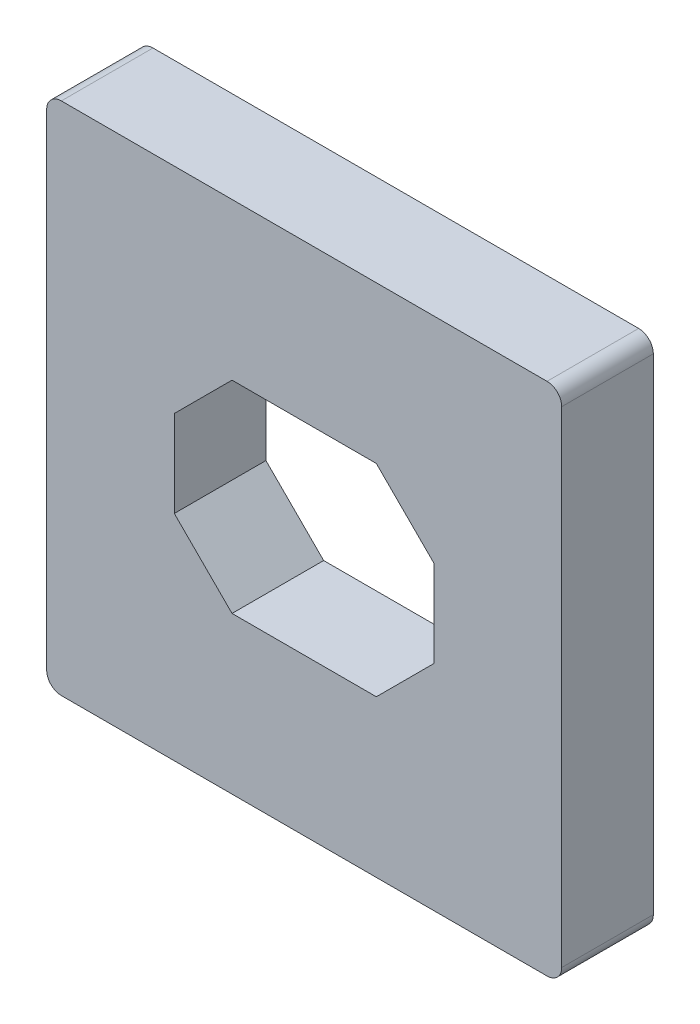
ISO-10303-21;
HEADER;
FILE_DESCRIPTION(('STEP AP214'),'2;1');
FILE_NAME('part.step','',(''),(''),'','','');
FILE_SCHEMA(('AUTOMOTIVE_DESIGN { 1 0 10303 214 1 1 1 1 }'));
ENDSEC;
DATA;
#1=APPLICATION_CONTEXT('core data for automotive mechanical design processes');
#2=APPLICATION_PROTOCOL_DEFINITION('international standard','automotive_design',2000,#1);
#3=PRODUCT_CONTEXT('',#1,'mechanical');
#4=PRODUCT('Part','Part','',(#3));
#5=PRODUCT_RELATED_PRODUCT_CATEGORY('part','',(#4));
#6=PRODUCT_DEFINITION_FORMATION('','',#4);
#7=PRODUCT_DEFINITION_CONTEXT('part definition',#1,'design');
#8=PRODUCT_DEFINITION('design','',#6,#7);
#9=PRODUCT_DEFINITION_SHAPE('','',#8);
#10=(LENGTH_UNIT() NAMED_UNIT(*) SI_UNIT(.MILLI.,.METRE.));
#11=(NAMED_UNIT(*) PLANE_ANGLE_UNIT() SI_UNIT($,.RADIAN.));
#12=(NAMED_UNIT(*) SI_UNIT($,.STERADIAN.) SOLID_ANGLE_UNIT());
#13=UNCERTAINTY_MEASURE_WITH_UNIT(LENGTH_MEASURE(1.E-05),#10,'distance_accuracy_value','');
#14=(GEOMETRIC_REPRESENTATION_CONTEXT(3) GLOBAL_UNCERTAINTY_ASSIGNED_CONTEXT((#13)) GLOBAL_UNIT_ASSIGNED_CONTEXT((#10,
#11,#12)) REPRESENTATION_CONTEXT('',''));
#15=CARTESIAN_POINT('',(0.,0.,0.));
#16=DIRECTION('',(0.,0.,1.));
#17=DIRECTION('',(1.,0.,0.));
#18=AXIS2_PLACEMENT_3D('',#15,#16,#17);
#19=CARTESIAN_POINT('',(4.207,4.207,1.5875));
#20=DIRECTION('',(0.,0.,-1.));
#21=DIRECTION('',(-1.,0.,0.));
#22=AXIS2_PLACEMENT_3D('',#19,#20,#21);
#23=CYLINDRICAL_SURFACE('',#22,0.254000000000002);
#24=CARTESIAN_POINT('',(4.207,4.207,0.));
#25=DIRECTION('',(0.,0.,1.));
#26=DIRECTION('',(1.,0.,0.));
#27=AXIS2_PLACEMENT_3D('',#24,#25,#26);
#28=CIRCLE('',#27,0.254000000000002);
#29=CARTESIAN_POINT('',(4.461,4.207,0.));
#30=VERTEX_POINT('',#29);
#31=CARTESIAN_POINT('',(4.207,4.461,0.));
#32=VERTEX_POINT('',#31);
#33=EDGE_CURVE('E176',#30,#32,#28,.T.);
#34=ORIENTED_EDGE('',*,*,#33,.T.);
#35=DIRECTION('',(0.,0.,-1.));
#36=VECTOR('',#35,1.);
#37=CARTESIAN_POINT('',(4.207,4.461,1.5875));
#38=LINE('',#37,#36);
#39=CARTESIAN_POINT('',(4.207,4.461,1.5875));
#40=VERTEX_POINT('',#39);
#41=EDGE_CURVE('E157',#40,#32,#38,.T.);
#42=ORIENTED_EDGE('',*,*,#41,.F.);
#43=CARTESIAN_POINT('',(4.207,4.207,1.5875));
#44=DIRECTION('',(0.,0.,1.));
#45=DIRECTION('',(1.,0.,0.));
#46=AXIS2_PLACEMENT_3D('',#43,#44,#45);
#47=CIRCLE('',#46,0.254000000000002);
#48=CARTESIAN_POINT('',(4.461,4.207,1.5875));
#49=VERTEX_POINT('',#48);
#50=EDGE_CURVE('E164',#49,#40,#47,.T.);
#51=ORIENTED_EDGE('',*,*,#50,.F.);
#52=DIRECTION('',(0.,0.,-1.));
#53=VECTOR('',#52,1.);
#54=CARTESIAN_POINT('',(4.461,4.207,1.5875));
#55=LINE('',#54,#53);
#56=EDGE_CURVE('E259',#49,#30,#55,.T.);
#57=ORIENTED_EDGE('',*,*,#56,.T.);
#58=EDGE_LOOP('',(#34,#42,#51,#57));
#59=FACE_BOUND('',#58,.T.);
#60=ADVANCED_FACE('F39',(#59),#23,.T.);
#61=CARTESIAN_POINT('',(4.207,4.461,1.5875));
#62=DIRECTION('',(0.,-1.,0.));
#63=DIRECTION('',(0.,0.,-1.));
#64=AXIS2_PLACEMENT_3D('',#61,#62,#63);
#65=PLANE('',#64);
#66=DIRECTION('',(-1.,0.,0.));
#67=VECTOR('',#66,1.);
#68=CARTESIAN_POINT('',(4.207,4.461,0.));
#69=LINE('',#68,#67);
#70=CARTESIAN_POINT('',(-4.207,4.461,0.));
#71=VERTEX_POINT('',#70);
#72=EDGE_CURVE('E261',#32,#71,#69,.T.);
#73=ORIENTED_EDGE('',*,*,#72,.T.);
#74=DIRECTION('',(0.,0.,-1.));
#75=VECTOR('',#74,1.);
#76=CARTESIAN_POINT('',(-4.207,4.461,1.5875));
#77=LINE('',#76,#75);
#78=CARTESIAN_POINT('',(-4.207,4.461,1.5875));
#79=VERTEX_POINT('',#78);
#80=EDGE_CURVE('E160',#79,#71,#77,.T.);
#81=ORIENTED_EDGE('',*,*,#80,.F.);
#82=DIRECTION('',(-1.,0.,0.));
#83=VECTOR('',#82,1.);
#84=CARTESIAN_POINT('',(4.207,4.461,1.5875));
#85=LINE('',#84,#83);
#86=EDGE_CURVE('E153',#40,#79,#85,.T.);
#87=ORIENTED_EDGE('',*,*,#86,.F.);
#88=ORIENTED_EDGE('',*,*,#41,.T.);
#89=EDGE_LOOP('',(#73,#81,#87,#88));
#90=FACE_BOUND('',#89,.T.);
#91=ADVANCED_FACE('F155',(#90),#65,.F.);
#92=CARTESIAN_POINT('',(-4.207,4.207,1.5875));
#93=DIRECTION('',(0.,0.,-1.));
#94=DIRECTION('',(-1.,0.,0.));
#95=AXIS2_PLACEMENT_3D('',#92,#93,#94);
#96=CYLINDRICAL_SURFACE('',#95,0.254);
#97=CARTESIAN_POINT('',(-4.207,4.207,0.));
#98=DIRECTION('',(0.,0.,1.));
#99=DIRECTION('',(1.,0.,0.));
#100=AXIS2_PLACEMENT_3D('',#97,#98,#99);
#101=CIRCLE('',#100,0.254);
#102=CARTESIAN_POINT('',(-4.461,4.207,0.));
#103=VERTEX_POINT('',#102);
#104=EDGE_CURVE('E263',#71,#103,#101,.T.);
#105=ORIENTED_EDGE('',*,*,#104,.T.);
#106=DIRECTION('',(0.,0.,-1.));
#107=VECTOR('',#106,1.);
#108=CARTESIAN_POINT('',(-4.461,4.207,1.5875));
#109=LINE('',#108,#107);
#110=CARTESIAN_POINT('',(-4.461,4.207,1.5875));
#111=VERTEX_POINT('',#110);
#112=EDGE_CURVE('E181',#111,#103,#109,.T.);
#113=ORIENTED_EDGE('',*,*,#112,.F.);
#114=CARTESIAN_POINT('',(-4.207,4.207,1.5875));
#115=DIRECTION('',(0.,0.,1.));
#116=DIRECTION('',(1.,0.,0.));
#117=AXIS2_PLACEMENT_3D('',#114,#115,#116);
#118=CIRCLE('',#117,0.254);
#119=EDGE_CURVE('E163',#79,#111,#118,.T.);
#120=ORIENTED_EDGE('',*,*,#119,.F.);
#121=ORIENTED_EDGE('',*,*,#80,.T.);
#122=EDGE_LOOP('',(#105,#113,#120,#121));
#123=FACE_BOUND('',#122,.T.);
#124=ADVANCED_FACE('F308',(#123),#96,.T.);
#125=CARTESIAN_POINT('',(-4.461,4.207,1.5875));
#126=DIRECTION('',(1.,0.,0.));
#127=DIRECTION('',(0.,0.,-1.));
#128=AXIS2_PLACEMENT_3D('',#125,#126,#127);
#129=PLANE('',#128);
#130=DIRECTION('',(0.,-1.,0.));
#131=VECTOR('',#130,1.);
#132=CARTESIAN_POINT('',(-4.461,4.207,0.));
#133=LINE('',#132,#131);
#134=CARTESIAN_POINT('',(-4.461,-4.207,0.));
#135=VERTEX_POINT('',#134);
#136=EDGE_CURVE('E265',#103,#135,#133,.T.);
#137=ORIENTED_EDGE('',*,*,#136,.T.);
#138=DIRECTION('',(0.,0.,-1.));
#139=VECTOR('',#138,1.);
#140=CARTESIAN_POINT('',(-4.461,-4.207,1.5875));
#141=LINE('',#140,#139);
#142=CARTESIAN_POINT('',(-4.461,-4.207,1.5875));
#143=VERTEX_POINT('',#142);
#144=EDGE_CURVE('E284',#143,#135,#141,.T.);
#145=ORIENTED_EDGE('',*,*,#144,.F.);
#146=DIRECTION('',(0.,-1.,0.));
#147=VECTOR('',#146,1.);
#148=CARTESIAN_POINT('',(-4.461,4.207,1.5875));
#149=LINE('',#148,#147);
#150=EDGE_CURVE('E250',#111,#143,#149,.T.);
#151=ORIENTED_EDGE('',*,*,#150,.F.);
#152=ORIENTED_EDGE('',*,*,#112,.T.);
#153=EDGE_LOOP('',(#137,#145,#151,#152));
#154=FACE_BOUND('',#153,.T.);
#155=ADVANCED_FACE('F291',(#154),#129,.F.);
#156=CARTESIAN_POINT('',(-4.207,-4.207,1.5875));
#157=DIRECTION('',(0.,0.,-1.));
#158=DIRECTION('',(-1.,0.,0.));
#159=AXIS2_PLACEMENT_3D('',#156,#157,#158);
#160=CYLINDRICAL_SURFACE('',#159,0.254000000000003);
#161=CARTESIAN_POINT('',(-4.207,-4.207,0.));
#162=DIRECTION('',(0.,0.,1.));
#163=DIRECTION('',(1.,0.,0.));
#164=AXIS2_PLACEMENT_3D('',#161,#162,#163);
#165=CIRCLE('',#164,0.254000000000003);
#166=CARTESIAN_POINT('',(-4.207,-4.461,0.));
#167=VERTEX_POINT('',#166);
#168=EDGE_CURVE('E267',#135,#167,#165,.T.);
#169=ORIENTED_EDGE('',*,*,#168,.T.);
#170=DIRECTION('',(0.,0.,-1.));
#171=VECTOR('',#170,1.);
#172=CARTESIAN_POINT('',(-4.207,-4.461,1.5875));
#173=LINE('',#172,#171);
#174=CARTESIAN_POINT('',(-4.207,-4.461,1.5875));
#175=VERTEX_POINT('',#174);
#176=EDGE_CURVE('E281',#175,#167,#173,.T.);
#177=ORIENTED_EDGE('',*,*,#176,.F.);
#178=CARTESIAN_POINT('',(-4.207,-4.207,1.5875));
#179=DIRECTION('',(0.,0.,1.));
#180=DIRECTION('',(1.,0.,0.));
#181=AXIS2_PLACEMENT_3D('',#178,#179,#180);
#182=CIRCLE('',#181,0.254000000000003);
#183=EDGE_CURVE('E252',#143,#175,#182,.T.);
#184=ORIENTED_EDGE('',*,*,#183,.F.);
#185=ORIENTED_EDGE('',*,*,#144,.T.);
#186=EDGE_LOOP('',(#169,#177,#184,#185));
#187=FACE_BOUND('',#186,.T.);
#188=ADVANCED_FACE('F300',(#187),#160,.T.);
#189=CARTESIAN_POINT('',(-4.207,-4.461,1.5875));
#190=DIRECTION('',(0.,1.,0.));
#191=DIRECTION('',(0.,0.,1.));
#192=AXIS2_PLACEMENT_3D('',#189,#190,#191);
#193=PLANE('',#192);
#194=DIRECTION('',(1.,0.,0.));
#195=VECTOR('',#194,1.);
#196=CARTESIAN_POINT('',(-4.207,-4.461,0.));
#197=LINE('',#196,#195);
#198=CARTESIAN_POINT('',(4.207,-4.461,0.));
#199=VERTEX_POINT('',#198);
#200=EDGE_CURVE('E269',#167,#199,#197,.T.);
#201=ORIENTED_EDGE('',*,*,#200,.T.);
#202=DIRECTION('',(0.,0.,-1.));
#203=VECTOR('',#202,1.);
#204=CARTESIAN_POINT('',(4.207,-4.461,1.5875));
#205=LINE('',#204,#203);
#206=CARTESIAN_POINT('',(4.207,-4.461,1.5875));
#207=VERTEX_POINT('',#206);
#208=EDGE_CURVE('E278',#207,#199,#205,.T.);
#209=ORIENTED_EDGE('',*,*,#208,.F.);
#210=DIRECTION('',(1.,0.,0.));
#211=VECTOR('',#210,1.);
#212=CARTESIAN_POINT('',(-4.207,-4.461,1.5875));
#213=LINE('',#212,#211);
#214=EDGE_CURVE('E254',#175,#207,#213,.T.);
#215=ORIENTED_EDGE('',*,*,#214,.F.);
#216=ORIENTED_EDGE('',*,*,#176,.T.);
#217=EDGE_LOOP('',(#201,#209,#215,#216));
#218=FACE_BOUND('',#217,.T.);
#219=ADVANCED_FACE('F304',(#218),#193,.F.);
#220=CARTESIAN_POINT('',(4.207,-4.207,1.5875));
#221=DIRECTION('',(0.,0.,-1.));
#222=DIRECTION('',(-1.,0.,0.));
#223=AXIS2_PLACEMENT_3D('',#220,#221,#222);
#224=CYLINDRICAL_SURFACE('',#223,0.254);
#225=CARTESIAN_POINT('',(4.207,-4.207,0.));
#226=DIRECTION('',(0.,0.,1.));
#227=DIRECTION('',(1.,0.,0.));
#228=AXIS2_PLACEMENT_3D('',#225,#226,#227);
#229=CIRCLE('',#228,0.254);
#230=CARTESIAN_POINT('',(4.461,-4.207,0.));
#231=VERTEX_POINT('',#230);
#232=EDGE_CURVE('E271',#199,#231,#229,.T.);
#233=ORIENTED_EDGE('',*,*,#232,.T.);
#234=DIRECTION('',(0.,0.,-1.));
#235=VECTOR('',#234,1.);
#236=CARTESIAN_POINT('',(4.461,-4.207,1.5875));
#237=LINE('',#236,#235);
#238=CARTESIAN_POINT('',(4.461,-4.207,1.5875));
#239=VERTEX_POINT('',#238);
#240=EDGE_CURVE('E275',#239,#231,#237,.T.);
#241=ORIENTED_EDGE('',*,*,#240,.F.);
#242=CARTESIAN_POINT('',(4.207,-4.207,1.5875));
#243=DIRECTION('',(0.,0.,1.));
#244=DIRECTION('',(1.,0.,0.));
#245=AXIS2_PLACEMENT_3D('',#242,#243,#244);
#246=CIRCLE('',#245,0.254);
#247=EDGE_CURVE('E256',#207,#239,#246,.T.);
#248=ORIENTED_EDGE('',*,*,#247,.F.);
#249=ORIENTED_EDGE('',*,*,#208,.T.);
#250=EDGE_LOOP('',(#233,#241,#248,#249));
#251=FACE_BOUND('',#250,.T.);
#252=ADVANCED_FACE('F365',(#251),#224,.T.);
#253=CARTESIAN_POINT('',(4.461,-4.207,1.5875));
#254=DIRECTION('',(-1.,0.,0.));
#255=DIRECTION('',(0.,0.,1.));
#256=AXIS2_PLACEMENT_3D('',#253,#254,#255);
#257=PLANE('',#256);
#258=DIRECTION('',(0.,1.,0.));
#259=VECTOR('',#258,1.);
#260=CARTESIAN_POINT('',(4.461,-4.207,0.));
#261=LINE('',#260,#259);
#262=EDGE_CURVE('E173',#231,#30,#261,.T.);
#263=ORIENTED_EDGE('',*,*,#262,.T.);
#264=ORIENTED_EDGE('',*,*,#56,.F.);
#265=DIRECTION('',(0.,1.,0.));
#266=VECTOR('',#265,1.);
#267=CARTESIAN_POINT('',(4.461,-4.207,1.5875));
#268=LINE('',#267,#266);
#269=EDGE_CURVE('E169',#239,#49,#268,.T.);
#270=ORIENTED_EDGE('',*,*,#269,.F.);
#271=ORIENTED_EDGE('',*,*,#240,.T.);
#272=EDGE_LOOP('',(#263,#264,#270,#271));
#273=FACE_BOUND('',#272,.T.);
#274=ADVANCED_FACE('F360',(#273),#257,.F.);
#275=CARTESIAN_POINT('',(4.207,4.207,1.5875));
#276=DIRECTION('',(0.,0.,1.));
#277=DIRECTION('',(1.,0.,0.));
#278=AXIS2_PLACEMENT_3D('',#275,#276,#277);
#279=PLANE('',#278);
#280=DIRECTION('',(0.,1.,0.));
#281=VECTOR('',#280,1.);
#282=CARTESIAN_POINT('',(2.25,1.75,1.5875));
#283=LINE('',#282,#281);
#284=CARTESIAN_POINT('',(2.25,-0.749999999999994,1.5875));
#285=VERTEX_POINT('',#284);
#286=CARTESIAN_POINT('',(2.25,0.750000000000004,1.5875));
#287=VERTEX_POINT('',#286);
#288=EDGE_CURVE('E222',#285,#287,#283,.T.);
#289=ORIENTED_EDGE('',*,*,#288,.F.);
#290=DIRECTION('',(0.707106781186544,0.707106781186551,0.));
#291=VECTOR('',#290,1.);
#292=CARTESIAN_POINT('',(2.25,-0.749999999999994,1.5875));
#293=LINE('',#292,#291);
#294=CARTESIAN_POINT('',(1.25000000000001,-1.75,1.5875));
#295=VERTEX_POINT('',#294);
#296=EDGE_CURVE('E205',#285,#295,#293,.F.);
#297=ORIENTED_EDGE('',*,*,#296,.T.);
#298=DIRECTION('',(1.,0.,0.));
#299=VECTOR('',#298,1.);
#300=CARTESIAN_POINT('',(-2.25,-1.75,1.5875));
#301=LINE('',#300,#299);
#302=CARTESIAN_POINT('',(-1.24999999999999,-1.75,1.5875));
#303=VERTEX_POINT('',#302);
#304=EDGE_CURVE('E246',#303,#295,#301,.T.);
#305=ORIENTED_EDGE('',*,*,#304,.F.);
#306=DIRECTION('',(0.707106781186551,-0.707106781186544,0.));
#307=VECTOR('',#306,1.);
#308=CARTESIAN_POINT('',(-1.24999999999999,-1.75,1.5875));
#309=LINE('',#308,#307);
#310=CARTESIAN_POINT('',(-2.25,-0.750000000000003,1.5875));
#311=VERTEX_POINT('',#310);
#312=EDGE_CURVE('E201',#303,#311,#309,.F.);
#313=ORIENTED_EDGE('',*,*,#312,.T.);
#314=DIRECTION('',(0.,-1.,0.));
#315=VECTOR('',#314,1.);
#316=CARTESIAN_POINT('',(-2.25,1.75,1.5875));
#317=LINE('',#316,#315);
#318=CARTESIAN_POINT('',(-2.25,0.749999999999994,1.5875));
#319=VERTEX_POINT('',#318);
#320=EDGE_CURVE('E217',#319,#311,#317,.T.);
#321=ORIENTED_EDGE('',*,*,#320,.F.);
#322=DIRECTION('',(-0.707106781186544,-0.707106781186551,0.));
#323=VECTOR('',#322,1.);
#324=CARTESIAN_POINT('',(-2.25,0.749999999999994,1.5875));
#325=LINE('',#324,#323);
#326=CARTESIAN_POINT('',(-1.25,1.75,1.5875));
#327=VERTEX_POINT('',#326);
#328=EDGE_CURVE('E47',#319,#327,#325,.F.);
#329=ORIENTED_EDGE('',*,*,#328,.T.);
#330=DIRECTION('',(-1.,0.,0.));
#331=VECTOR('',#330,1.);
#332=CARTESIAN_POINT('',(-2.25,1.75,1.5875));
#333=LINE('',#332,#331);
#334=CARTESIAN_POINT('',(1.25,1.75,1.5875));
#335=VERTEX_POINT('',#334);
#336=EDGE_CURVE('E215',#335,#327,#333,.T.);
#337=ORIENTED_EDGE('',*,*,#336,.F.);
#338=DIRECTION('',(-0.707106781186551,0.707106781186544,0.));
#339=VECTOR('',#338,1.);
#340=CARTESIAN_POINT('',(1.25,1.75,1.5875));
#341=LINE('',#340,#339);
#342=EDGE_CURVE('E209',#335,#287,#341,.F.);
#343=ORIENTED_EDGE('',*,*,#342,.T.);
#344=EDGE_LOOP('',(#289,#297,#305,#313,#321,#329,#337,#343));
#345=FACE_BOUND('',#344,.T.);
#346=ORIENTED_EDGE('',*,*,#50,.T.);
#347=ORIENTED_EDGE('',*,*,#86,.T.);
#348=ORIENTED_EDGE('',*,*,#119,.T.);
#349=ORIENTED_EDGE('',*,*,#150,.T.);
#350=ORIENTED_EDGE('',*,*,#183,.T.);
#351=ORIENTED_EDGE('',*,*,#214,.T.);
#352=ORIENTED_EDGE('',*,*,#247,.T.);
#353=ORIENTED_EDGE('',*,*,#269,.T.);
#354=EDGE_LOOP('',(#346,#347,#348,#349,#350,#351,#352,#353));
#355=FACE_BOUND('',#354,.T.);
#356=ADVANCED_FACE('F167',(#345,#355),#279,.T.);
#357=CARTESIAN_POINT('',(4.207,4.207,0.));
#358=DIRECTION('',(0.,0.,1.));
#359=DIRECTION('',(1.,0.,0.));
#360=AXIS2_PLACEMENT_3D('',#357,#358,#359);
#361=PLANE('',#360);
#362=DIRECTION('',(0.,-1.,0.));
#363=VECTOR('',#362,1.);
#364=CARTESIAN_POINT('',(-2.25,1.75,0.));
#365=LINE('',#364,#363);
#366=CARTESIAN_POINT('',(-2.25,0.749999999999994,0.));
#367=VERTEX_POINT('',#366);
#368=CARTESIAN_POINT('',(-2.25,-0.750000000000003,0.));
#369=VERTEX_POINT('',#368);
#370=EDGE_CURVE('E229',#367,#369,#365,.T.);
#371=ORIENTED_EDGE('',*,*,#370,.T.);
#372=DIRECTION('',(-0.707106781186551,0.707106781186544,0.));
#373=VECTOR('',#372,1.);
#374=CARTESIAN_POINT('',(-1.49999999999997,-1.50000000000003,0.));
#375=LINE('',#374,#373);
#376=CARTESIAN_POINT('',(-1.24999999999999,-1.75,0.));
#377=VERTEX_POINT('',#376);
#378=EDGE_CURVE('E203',#369,#377,#375,.F.);
#379=ORIENTED_EDGE('',*,*,#378,.T.);
#380=DIRECTION('',(1.,0.,0.));
#381=VECTOR('',#380,1.);
#382=CARTESIAN_POINT('',(-2.25,-1.75,0.));
#383=LINE('',#382,#381);
#384=CARTESIAN_POINT('',(1.25000000000001,-1.75,0.));
#385=VERTEX_POINT('',#384);
#386=EDGE_CURVE('E235',#377,#385,#383,.T.);
#387=ORIENTED_EDGE('',*,*,#386,.T.);
#388=DIRECTION('',(-0.707106781186544,-0.707106781186551,0.));
#389=VECTOR('',#388,1.);
#390=CARTESIAN_POINT('',(5.70699999999999,2.70700000000003,0.));
#391=LINE('',#390,#389);
#392=CARTESIAN_POINT('',(2.25,-0.749999999999994,0.));
#393=VERTEX_POINT('',#392);
#394=EDGE_CURVE('E207',#385,#393,#391,.F.);
#395=ORIENTED_EDGE('',*,*,#394,.T.);
#396=DIRECTION('',(0.,1.,0.));
#397=VECTOR('',#396,1.);
#398=CARTESIAN_POINT('',(2.25,1.75,0.));
#399=LINE('',#398,#397);
#400=CARTESIAN_POINT('',(2.25,0.750000000000004,0.));
#401=VERTEX_POINT('',#400);
#402=EDGE_CURVE('E239',#393,#401,#399,.T.);
#403=ORIENTED_EDGE('',*,*,#402,.T.);
#404=DIRECTION('',(0.707106781186551,-0.707106781186544,0.));
#405=VECTOR('',#404,1.);
#406=CARTESIAN_POINT('',(1.50000000000001,1.49999999999998,0.));
#407=LINE('',#406,#405);
#408=CARTESIAN_POINT('',(1.25,1.75,0.));
#409=VERTEX_POINT('',#408);
#410=EDGE_CURVE('E61',#401,#409,#407,.F.);
#411=ORIENTED_EDGE('',*,*,#410,.T.);
#412=DIRECTION('',(-1.,0.,0.));
#413=VECTOR('',#412,1.);
#414=CARTESIAN_POINT('',(-2.25,1.75,0.));
#415=LINE('',#414,#413);
#416=CARTESIAN_POINT('',(-1.25,1.75,0.));
#417=VERTEX_POINT('',#416);
#418=EDGE_CURVE('E231',#409,#417,#415,.T.);
#419=ORIENTED_EDGE('',*,*,#418,.T.);
#420=DIRECTION('',(0.707106781186544,0.707106781186551,0.));
#421=VECTOR('',#420,1.);
#422=CARTESIAN_POINT('',(2.70699999999997,5.70700000000001,0.));
#423=LINE('',#422,#421);
#424=EDGE_CURVE('E11',#417,#367,#423,.F.);
#425=ORIENTED_EDGE('',*,*,#424,.T.);
#426=EDGE_LOOP('',(#371,#379,#387,#395,#403,#411,#419,#425));
#427=FACE_BOUND('',#426,.T.);
#428=ORIENTED_EDGE('',*,*,#33,.F.);
#429=ORIENTED_EDGE('',*,*,#262,.F.);
#430=ORIENTED_EDGE('',*,*,#232,.F.);
#431=ORIENTED_EDGE('',*,*,#200,.F.);
#432=ORIENTED_EDGE('',*,*,#168,.F.);
#433=ORIENTED_EDGE('',*,*,#136,.F.);
#434=ORIENTED_EDGE('',*,*,#104,.F.);
#435=ORIENTED_EDGE('',*,*,#72,.F.);
#436=EDGE_LOOP('',(#428,#429,#430,#431,#432,#433,#434,#435));
#437=FACE_BOUND('',#436,.T.);
#438=ADVANCED_FACE('F227',(#427,#437),#361,.F.);
#439=CARTESIAN_POINT('',(2.25,1.75,0.));
#440=DIRECTION('',(1.,0.,0.));
#441=DIRECTION('',(0.,1.,0.));
#442=AXIS2_PLACEMENT_3D('',#439,#440,#441);
#443=PLANE('',#442);
#444=ORIENTED_EDGE('',*,*,#402,.F.);
#445=DIRECTION('',(0.,0.,1.));
#446=VECTOR('',#445,1.);
#447=CARTESIAN_POINT('',(2.25,-0.749999999999994,1.5875));
#448=LINE('',#447,#446);
#449=EDGE_CURVE('E194',#393,#285,#448,.T.);
#450=ORIENTED_EDGE('',*,*,#449,.T.);
#451=ORIENTED_EDGE('',*,*,#288,.T.);
#452=DIRECTION('',(0.,0.,-1.));
#453=VECTOR('',#452,1.);
#454=CARTESIAN_POINT('',(2.25,0.750000000000004,0.));
#455=LINE('',#454,#453);
#456=EDGE_CURVE('E192',#287,#401,#455,.T.);
#457=ORIENTED_EDGE('',*,*,#456,.T.);
#458=EDGE_LOOP('',(#444,#450,#451,#457));
#459=FACE_BOUND('',#458,.T.);
#460=ADVANCED_FACE('F338',(#459),#443,.F.);
#461=CARTESIAN_POINT('',(-2.25,-1.75,0.));
#462=DIRECTION('',(0.,-1.,0.));
#463=DIRECTION('',(0.,0.,-1.));
#464=AXIS2_PLACEMENT_3D('',#461,#462,#463);
#465=PLANE('',#464);
#466=ORIENTED_EDGE('',*,*,#386,.F.);
#467=DIRECTION('',(0.,0.,1.));
#468=VECTOR('',#467,1.);
#469=CARTESIAN_POINT('',(-1.24999999999999,-1.75,1.5875));
#470=LINE('',#469,#468);
#471=EDGE_CURVE('E179',#377,#303,#470,.T.);
#472=ORIENTED_EDGE('',*,*,#471,.T.);
#473=ORIENTED_EDGE('',*,*,#304,.T.);
#474=DIRECTION('',(0.,0.,-1.));
#475=VECTOR('',#474,1.);
#476=CARTESIAN_POINT('',(1.25000000000001,-1.75,0.));
#477=LINE('',#476,#475);
#478=EDGE_CURVE('E177',#295,#385,#477,.T.);
#479=ORIENTED_EDGE('',*,*,#478,.T.);
#480=EDGE_LOOP('',(#466,#472,#473,#479));
#481=FACE_BOUND('',#480,.T.);
#482=ADVANCED_FACE('F345',(#481),#465,.F.);
#483=CARTESIAN_POINT('',(-2.25,1.75,0.));
#484=DIRECTION('',(-1.,0.,0.));
#485=DIRECTION('',(0.,-1.,0.));
#486=AXIS2_PLACEMENT_3D('',#483,#484,#485);
#487=PLANE('',#486);
#488=ORIENTED_EDGE('',*,*,#320,.T.);
#489=DIRECTION('',(0.,0.,-1.));
#490=VECTOR('',#489,1.);
#491=CARTESIAN_POINT('',(-2.25,-0.750000000000004,0.));
#492=LINE('',#491,#490);
#493=EDGE_CURVE('E190',#311,#369,#492,.T.);
#494=ORIENTED_EDGE('',*,*,#493,.T.);
#495=ORIENTED_EDGE('',*,*,#370,.F.);
#496=DIRECTION('',(0.,0.,1.));
#497=VECTOR('',#496,1.);
#498=CARTESIAN_POINT('',(-2.25,0.749999999999994,1.5875));
#499=LINE('',#498,#497);
#500=EDGE_CURVE('E187',#367,#319,#499,.T.);
#501=ORIENTED_EDGE('',*,*,#500,.T.);
#502=EDGE_LOOP('',(#488,#494,#495,#501));
#503=FACE_BOUND('',#502,.T.);
#504=ADVANCED_FACE('F233',(#503),#487,.F.);
#505=CARTESIAN_POINT('',(-2.25,1.75,0.));
#506=DIRECTION('',(0.,1.,0.));
#507=DIRECTION('',(-1.,0.,0.));
#508=AXIS2_PLACEMENT_3D('',#505,#506,#507);
#509=PLANE('',#508);
#510=ORIENTED_EDGE('',*,*,#418,.F.);
#511=DIRECTION('',(0.,0.,1.));
#512=VECTOR('',#511,1.);
#513=CARTESIAN_POINT('',(1.25,1.75,1.5875));
#514=LINE('',#513,#512);
#515=EDGE_CURVE('E198',#409,#335,#514,.T.);
#516=ORIENTED_EDGE('',*,*,#515,.T.);
#517=ORIENTED_EDGE('',*,*,#336,.T.);
#518=DIRECTION('',(0.,0.,-1.));
#519=VECTOR('',#518,1.);
#520=CARTESIAN_POINT('',(-1.25,1.75,0.));
#521=LINE('',#520,#519);
#522=EDGE_CURVE('E54',#327,#417,#521,.T.);
#523=ORIENTED_EDGE('',*,*,#522,.T.);
#524=EDGE_LOOP('',(#510,#516,#517,#523));
#525=FACE_BOUND('',#524,.T.);
#526=ADVANCED_FACE('F220',(#525),#509,.F.);
#527=CARTESIAN_POINT('',(-1.24999999999999,-1.75,0.));
#528=DIRECTION('',(0.707106781186544,0.707106781186551,0.));
#529=DIRECTION('',(0.,0.,-1.));
#530=AXIS2_PLACEMENT_3D('',#527,#528,#529);
#531=PLANE('',#530);
#532=ORIENTED_EDGE('',*,*,#378,.F.);
#533=ORIENTED_EDGE('',*,*,#493,.F.);
#534=ORIENTED_EDGE('',*,*,#312,.F.);
#535=ORIENTED_EDGE('',*,*,#471,.F.);
#536=EDGE_LOOP('',(#532,#533,#534,#535));
#537=FACE_BOUND('',#536,.T.);
#538=ADVANCED_FACE('F322',(#537),#531,.T.);
#539=CARTESIAN_POINT('',(2.25,-0.749999999999994,0.));
#540=DIRECTION('',(-0.707106781186551,0.707106781186544,0.));
#541=DIRECTION('',(0.,0.,-1.));
#542=AXIS2_PLACEMENT_3D('',#539,#540,#541);
#543=PLANE('',#542);
#544=ORIENTED_EDGE('',*,*,#394,.F.);
#545=ORIENTED_EDGE('',*,*,#478,.F.);
#546=ORIENTED_EDGE('',*,*,#296,.F.);
#547=ORIENTED_EDGE('',*,*,#449,.F.);
#548=EDGE_LOOP('',(#544,#545,#546,#547));
#549=FACE_BOUND('',#548,.T.);
#550=ADVANCED_FACE('F325',(#549),#543,.T.);
#551=CARTESIAN_POINT('',(1.25,1.75,0.));
#552=DIRECTION('',(-0.707106781186544,-0.707106781186551,0.));
#553=DIRECTION('',(0.,0.,-1.));
#554=AXIS2_PLACEMENT_3D('',#551,#552,#553);
#555=PLANE('',#554);
#556=ORIENTED_EDGE('',*,*,#410,.F.);
#557=ORIENTED_EDGE('',*,*,#456,.F.);
#558=ORIENTED_EDGE('',*,*,#342,.F.);
#559=ORIENTED_EDGE('',*,*,#515,.F.);
#560=EDGE_LOOP('',(#556,#557,#558,#559));
#561=FACE_BOUND('',#560,.T.);
#562=ADVANCED_FACE('F328',(#561),#555,.T.);
#563=CARTESIAN_POINT('',(-2.25,0.749999999999994,0.));
#564=DIRECTION('',(0.707106781186551,-0.707106781186544,0.));
#565=DIRECTION('',(0.,0.,-1.));
#566=AXIS2_PLACEMENT_3D('',#563,#564,#565);
#567=PLANE('',#566);
#568=ORIENTED_EDGE('',*,*,#424,.F.);
#569=ORIENTED_EDGE('',*,*,#522,.F.);
#570=ORIENTED_EDGE('',*,*,#328,.F.);
#571=ORIENTED_EDGE('',*,*,#500,.F.);
#572=EDGE_LOOP('',(#568,#569,#570,#571));
#573=FACE_BOUND('',#572,.T.);
#574=ADVANCED_FACE('F41',(#573),#567,.T.);
#575=CLOSED_SHELL('',(#60,#91,#124,#155,#188,#219,#252,#274,#356,#438,#460,#482,#504,#526,#538,
#550,#562,#574));
#576=MANIFOLD_SOLID_BREP('B2',#575);
#577=ADVANCED_BREP_SHAPE_REPRESENTATION('',(#18,#576),#14);
#578=SHAPE_DEFINITION_REPRESENTATION(#9,#577);
ENDSEC;
END-ISO-10303-21;
